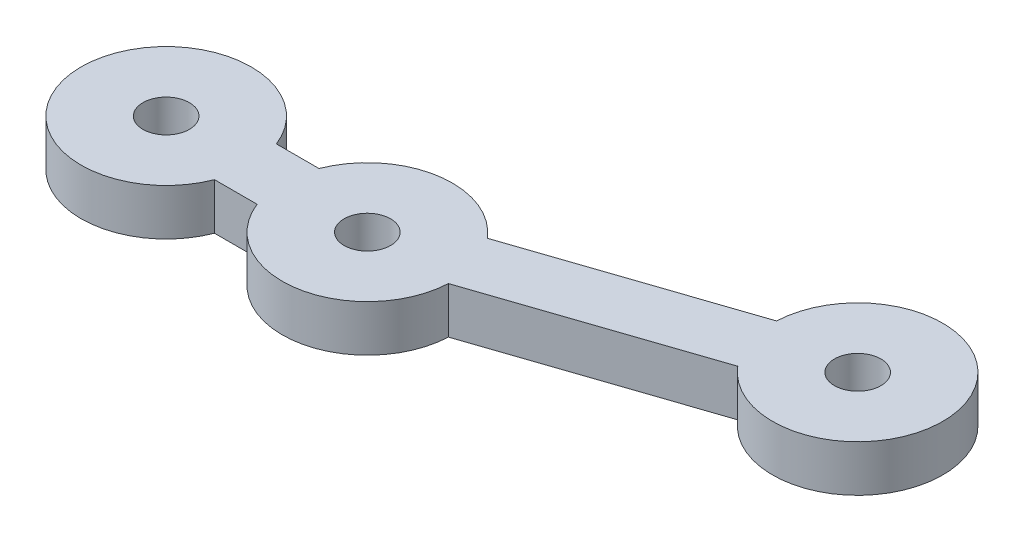
ISO-10303-21;
HEADER;
FILE_DESCRIPTION(('STEP AP214'),'2;1');
FILE_NAME('part.step','',(''),(''),'','','');
FILE_SCHEMA(('AUTOMOTIVE_DESIGN { 1 0 10303 214 1 1 1 1 }'));
ENDSEC;
DATA;
#1=APPLICATION_CONTEXT('core data for automotive mechanical design processes');
#2=APPLICATION_PROTOCOL_DEFINITION('international standard','automotive_design',2000,#1);
#3=PRODUCT_CONTEXT('',#1,'mechanical');
#4=PRODUCT('Part','Part','',(#3));
#5=PRODUCT_RELATED_PRODUCT_CATEGORY('part','',(#4));
#6=PRODUCT_DEFINITION_FORMATION('','',#4);
#7=PRODUCT_DEFINITION_CONTEXT('part definition',#1,'design');
#8=PRODUCT_DEFINITION('design','',#6,#7);
#9=PRODUCT_DEFINITION_SHAPE('','',#8);
#10=(LENGTH_UNIT() NAMED_UNIT(*) SI_UNIT(.MILLI.,.METRE.));
#11=(NAMED_UNIT(*) PLANE_ANGLE_UNIT() SI_UNIT($,.RADIAN.));
#12=(NAMED_UNIT(*) SI_UNIT($,.STERADIAN.) SOLID_ANGLE_UNIT());
#13=UNCERTAINTY_MEASURE_WITH_UNIT(LENGTH_MEASURE(1.E-05),#10,'distance_accuracy_value','');
#14=(GEOMETRIC_REPRESENTATION_CONTEXT(3) GLOBAL_UNCERTAINTY_ASSIGNED_CONTEXT((#13)) GLOBAL_UNIT_ASSIGNED_CONTEXT((#10,
#11,#12)) REPRESENTATION_CONTEXT('',''));
#15=CARTESIAN_POINT('',(0.,0.,0.));
#16=DIRECTION('',(0.,0.,1.));
#17=DIRECTION('',(1.,0.,0.));
#18=AXIS2_PLACEMENT_3D('',#15,#16,#17);
#19=CARTESIAN_POINT('',(1.9712,3.,5.83609206233075));
#20=DIRECTION('',(-0.32,0.,-0.947417542586161));
#21=DIRECTION('',(-0.947417542586161,0.,0.32));
#22=AXIS2_PLACEMENT_3D('',#19,#20,#21);
#23=PLANE('',#22);
#24=DIRECTION('',(0.947417542586161,0.,-0.32));
#25=VECTOR('',#24,1.);
#26=CARTESIAN_POINT('',(1.9712,0.,5.83609206233075));
#27=LINE('',#26,#25);
#28=CARTESIAN_POINT('',(18.4940704568434,0.,0.255322962618782));
#29=VERTEX_POINT('',#28);
#30=CARTESIAN_POINT('',(32.4713681078106,0.,-4.46565279227414));
#31=VERTEX_POINT('',#30);
#32=EDGE_CURVE('E140',#29,#31,#27,.T.);
#33=ORIENTED_EDGE('',*,*,#32,.T.);
#34=DIRECTION('',(0.,-1.,0.));
#35=VECTOR('',#34,1.);
#36=CARTESIAN_POINT('',(32.4713681078106,3.,-4.46565279227414));
#37=LINE('',#36,#35);
#38=CARTESIAN_POINT('',(32.4713681078106,3.,-4.46565279227414));
#39=VERTEX_POINT('',#38);
#40=EDGE_CURVE('E11',#39,#31,#37,.T.);
#41=ORIENTED_EDGE('',*,*,#40,.F.);
#42=DIRECTION('',(0.947417542586161,0.,-0.32));
#43=VECTOR('',#42,1.);
#44=CARTESIAN_POINT('',(1.9712,3.,5.83609206233075));
#45=LINE('',#44,#43);
#46=CARTESIAN_POINT('',(18.4940704568434,3.,0.255322962618782));
#47=VERTEX_POINT('',#46);
#48=EDGE_CURVE('E167',#47,#39,#45,.T.);
#49=ORIENTED_EDGE('',*,*,#48,.F.);
#50=DIRECTION('',(0.,-1.,0.));
#51=VECTOR('',#50,1.);
#52=CARTESIAN_POINT('',(18.4940704568434,3.,0.255322962618782));
#53=LINE('',#52,#51);
#54=EDGE_CURVE('E139',#47,#29,#53,.T.);
#55=ORIENTED_EDGE('',*,*,#54,.T.);
#56=EDGE_LOOP('',(#33,#41,#49,#55));
#57=FACE_BOUND('',#56,.T.);
#58=ADVANCED_FACE('F35',(#57),#23,.F.);
#59=CARTESIAN_POINT('',(36.685438564654,3.,-8.));
#60=DIRECTION('',(0.,-1.,0.));
#61=DIRECTION('',(0.,0.,-1.));
#62=AXIS2_PLACEMENT_3D('',#59,#60,#61);
#63=CYLINDRICAL_SURFACE('',#62,5.5);
#64=CARTESIAN_POINT('',(36.685438564654,0.,-8.));
#65=DIRECTION('',(0.,1.,0.));
#66=DIRECTION('',(0.,0.,1.));
#67=AXIS2_PLACEMENT_3D('',#64,#65,#66);
#68=CIRCLE('',#67,5.5);
#69=CARTESIAN_POINT('',(31.1913681078106,0.,-8.25532296261879));
#70=VERTEX_POINT('',#69);
#71=EDGE_CURVE('E143',#31,#70,#68,.T.);
#72=ORIENTED_EDGE('',*,*,#71,.T.);
#73=DIRECTION('',(0.,-1.,0.));
#74=VECTOR('',#73,1.);
#75=CARTESIAN_POINT('',(31.1913681078106,3.,-8.25532296261879));
#76=LINE('',#75,#74);
#77=CARTESIAN_POINT('',(31.1913681078106,3.,-8.25532296261879));
#78=VERTEX_POINT('',#77);
#79=EDGE_CURVE('E43',#78,#70,#76,.T.);
#80=ORIENTED_EDGE('',*,*,#79,.F.);
#81=CARTESIAN_POINT('',(36.685438564654,3.,-8.));
#82=DIRECTION('',(0.,1.,0.));
#83=DIRECTION('',(0.,0.,1.));
#84=AXIS2_PLACEMENT_3D('',#81,#82,#83);
#85=CIRCLE('',#84,5.5);
#86=EDGE_CURVE('E94',#39,#78,#85,.T.);
#87=ORIENTED_EDGE('',*,*,#86,.F.);
#88=ORIENTED_EDGE('',*,*,#40,.T.);
#89=EDGE_LOOP('',(#72,#80,#87,#88));
#90=FACE_BOUND('',#89,.T.);
#91=ADVANCED_FACE('F180',(#90),#63,.T.);
#92=CARTESIAN_POINT('',(0.6912,3.,2.04642189198611));
#93=DIRECTION('',(-0.32,0.,-0.947417542586161));
#94=DIRECTION('',(-0.947417542586161,0.,0.32));
#95=AXIS2_PLACEMENT_3D('',#92,#93,#94);
#96=PLANE('',#95);
#97=DIRECTION('',(0.947417542586161,0.,-0.32));
#98=VECTOR('',#97,1.);
#99=CARTESIAN_POINT('',(0.6912,0.,2.04642189198611));
#100=LINE('',#99,#98);
#101=CARTESIAN_POINT('',(17.2140704568434,0.,-3.53434720772586));
#102=VERTEX_POINT('',#101);
#103=EDGE_CURVE('E146',#102,#70,#100,.T.);
#104=ORIENTED_EDGE('',*,*,#103,.F.);
#105=DIRECTION('',(0.,-1.,0.));
#106=VECTOR('',#105,1.);
#107=CARTESIAN_POINT('',(17.2140704568434,3.,-3.53434720772586));
#108=LINE('',#107,#106);
#109=CARTESIAN_POINT('',(17.2140704568434,3.,-3.53434720772586));
#110=VERTEX_POINT('',#109);
#111=EDGE_CURVE('E173',#110,#102,#108,.T.);
#112=ORIENTED_EDGE('',*,*,#111,.F.);
#113=DIRECTION('',(0.947417542586161,0.,-0.32));
#114=VECTOR('',#113,1.);
#115=CARTESIAN_POINT('',(0.6912,3.,2.04642189198611));
#116=LINE('',#115,#114);
#117=EDGE_CURVE('E179',#110,#78,#116,.T.);
#118=ORIENTED_EDGE('',*,*,#117,.T.);
#119=ORIENTED_EDGE('',*,*,#79,.T.);
#120=EDGE_LOOP('',(#104,#112,#118,#119));
#121=FACE_BOUND('',#120,.T.);
#122=ADVANCED_FACE('F177',(#121),#96,.T.);
#123=CARTESIAN_POINT('',(13.,3.,0.));
#124=DIRECTION('',(0.,-1.,0.));
#125=DIRECTION('',(0.,0.,-1.));
#126=AXIS2_PLACEMENT_3D('',#123,#124,#125);
#127=CYLINDRICAL_SURFACE('',#126,5.5);
#128=CARTESIAN_POINT('',(13.,0.,0.));
#129=DIRECTION('',(0.,1.,0.));
#130=DIRECTION('',(0.,0.,1.));
#131=AXIS2_PLACEMENT_3D('',#128,#129,#130);
#132=CIRCLE('',#131,5.5);
#133=CARTESIAN_POINT('',(7.87652461702022,0.,-2.));
#134=VERTEX_POINT('',#133);
#135=EDGE_CURVE('E149',#102,#134,#132,.T.);
#136=ORIENTED_EDGE('',*,*,#135,.T.);
#137=DIRECTION('',(0.,-1.,0.));
#138=VECTOR('',#137,1.);
#139=CARTESIAN_POINT('',(7.87652461702022,3.,-2.));
#140=LINE('',#139,#138);
#141=CARTESIAN_POINT('',(7.87652461702022,3.,-2.));
#142=VERTEX_POINT('',#141);
#143=EDGE_CURVE('E171',#142,#134,#140,.T.);
#144=ORIENTED_EDGE('',*,*,#143,.F.);
#145=CARTESIAN_POINT('',(13.,3.,0.));
#146=DIRECTION('',(0.,1.,0.));
#147=DIRECTION('',(0.,0.,1.));
#148=AXIS2_PLACEMENT_3D('',#145,#146,#147);
#149=CIRCLE('',#148,5.5);
#150=EDGE_CURVE('E192',#110,#142,#149,.T.);
#151=ORIENTED_EDGE('',*,*,#150,.F.);
#152=ORIENTED_EDGE('',*,*,#111,.T.);
#153=EDGE_LOOP('',(#136,#144,#151,#152));
#154=FACE_BOUND('',#153,.T.);
#155=ADVANCED_FACE('F190',(#154),#127,.T.);
#156=CARTESIAN_POINT('',(0.,3.,-2.));
#157=DIRECTION('',(0.,0.,-1.));
#158=DIRECTION('',(-1.,0.,0.));
#159=AXIS2_PLACEMENT_3D('',#156,#157,#158);
#160=PLANE('',#159);
#161=DIRECTION('',(1.,0.,0.));
#162=VECTOR('',#161,1.);
#163=CARTESIAN_POINT('',(0.,0.,-2.));
#164=LINE('',#163,#162);
#165=CARTESIAN_POINT('',(5.1234753829798,0.,-2.));
#166=VERTEX_POINT('',#165);
#167=EDGE_CURVE('E152',#166,#134,#164,.T.);
#168=ORIENTED_EDGE('',*,*,#167,.F.);
#169=DIRECTION('',(0.,-1.,0.));
#170=VECTOR('',#169,1.);
#171=CARTESIAN_POINT('',(5.1234753829798,3.,-2.));
#172=LINE('',#171,#170);
#173=CARTESIAN_POINT('',(5.1234753829798,3.,-2.));
#174=VERTEX_POINT('',#173);
#175=EDGE_CURVE('E122',#174,#166,#172,.T.);
#176=ORIENTED_EDGE('',*,*,#175,.F.);
#177=DIRECTION('',(1.,0.,0.));
#178=VECTOR('',#177,1.);
#179=CARTESIAN_POINT('',(0.,3.,-2.));
#180=LINE('',#179,#178);
#181=EDGE_CURVE('E115',#174,#142,#180,.T.);
#182=ORIENTED_EDGE('',*,*,#181,.T.);
#183=ORIENTED_EDGE('',*,*,#143,.T.);
#184=EDGE_LOOP('',(#168,#176,#182,#183));
#185=FACE_BOUND('',#184,.T.);
#186=ADVANCED_FACE('F198',(#185),#160,.T.);
#187=CARTESIAN_POINT('',(0.,3.,0.));
#188=DIRECTION('',(0.,-1.,0.));
#189=DIRECTION('',(0.,0.,-1.));
#190=AXIS2_PLACEMENT_3D('',#187,#188,#189);
#191=CYLINDRICAL_SURFACE('',#190,5.5);
#192=CARTESIAN_POINT('',(0.,0.,0.));
#193=DIRECTION('',(0.,1.,0.));
#194=DIRECTION('',(0.,0.,1.));
#195=AXIS2_PLACEMENT_3D('',#192,#193,#194);
#196=CIRCLE('',#195,5.5);
#197=CARTESIAN_POINT('',(5.1234753829798,0.,2.));
#198=VERTEX_POINT('',#197);
#199=EDGE_CURVE('E121',#166,#198,#196,.T.);
#200=ORIENTED_EDGE('',*,*,#199,.T.);
#201=DIRECTION('',(0.,-1.,0.));
#202=VECTOR('',#201,1.);
#203=CARTESIAN_POINT('',(5.1234753829798,3.,2.));
#204=LINE('',#203,#202);
#205=CARTESIAN_POINT('',(5.1234753829798,3.,2.));
#206=VERTEX_POINT('',#205);
#207=EDGE_CURVE('E118',#206,#198,#204,.T.);
#208=ORIENTED_EDGE('',*,*,#207,.F.);
#209=CARTESIAN_POINT('',(0.,3.,0.));
#210=DIRECTION('',(0.,1.,0.));
#211=DIRECTION('',(0.,0.,1.));
#212=AXIS2_PLACEMENT_3D('',#209,#210,#211);
#213=CIRCLE('',#212,5.5);
#214=EDGE_CURVE('E108',#174,#206,#213,.T.);
#215=ORIENTED_EDGE('',*,*,#214,.F.);
#216=ORIENTED_EDGE('',*,*,#175,.T.);
#217=EDGE_LOOP('',(#200,#208,#215,#216));
#218=FACE_BOUND('',#217,.T.);
#219=ADVANCED_FACE('F119',(#218),#191,.T.);
#220=CARTESIAN_POINT('',(0.,3.,2.));
#221=DIRECTION('',(0.,0.,-1.));
#222=DIRECTION('',(-1.,0.,0.));
#223=AXIS2_PLACEMENT_3D('',#220,#221,#222);
#224=PLANE('',#223);
#225=DIRECTION('',(1.,0.,0.));
#226=VECTOR('',#225,1.);
#227=CARTESIAN_POINT('',(0.,0.,2.));
#228=LINE('',#227,#226);
#229=CARTESIAN_POINT('',(7.87652461702022,0.,2.));
#230=VERTEX_POINT('',#229);
#231=EDGE_CURVE('E80',#198,#230,#228,.T.);
#232=ORIENTED_EDGE('',*,*,#231,.T.);
#233=DIRECTION('',(0.,-1.,0.));
#234=VECTOR('',#233,1.);
#235=CARTESIAN_POINT('',(7.87652461702022,3.,2.));
#236=LINE('',#235,#234);
#237=CARTESIAN_POINT('',(7.87652461702022,3.,2.));
#238=VERTEX_POINT('',#237);
#239=EDGE_CURVE('E123',#238,#230,#236,.T.);
#240=ORIENTED_EDGE('',*,*,#239,.F.);
#241=DIRECTION('',(1.,0.,0.));
#242=VECTOR('',#241,1.);
#243=CARTESIAN_POINT('',(0.,3.,2.));
#244=LINE('',#243,#242);
#245=EDGE_CURVE('E113',#206,#238,#244,.T.);
#246=ORIENTED_EDGE('',*,*,#245,.F.);
#247=ORIENTED_EDGE('',*,*,#207,.T.);
#248=EDGE_LOOP('',(#232,#240,#246,#247));
#249=FACE_BOUND('',#248,.T.);
#250=ADVANCED_FACE('F125',(#249),#224,.F.);
#251=CARTESIAN_POINT('',(0.,3.,0.));
#252=DIRECTION('',(0.,-1.,0.));
#253=DIRECTION('',(0.,0.,-1.));
#254=AXIS2_PLACEMENT_3D('',#251,#252,#253);
#255=CYLINDRICAL_SURFACE('',#254,1.5);
#256=CARTESIAN_POINT('',(0.,3.,0.));
#257=DIRECTION('',(0.,1.,0.));
#258=DIRECTION('',(0.,0.,1.));
#259=AXIS2_PLACEMENT_3D('',#256,#257,#258);
#260=CIRCLE('',#259,1.5);
#261=CARTESIAN_POINT('',(0.,3.,1.5));
#262=VERTEX_POINT('',#261);
#263=EDGE_CURVE('E133',#262,#262,#260,.T.);
#264=ORIENTED_EDGE('',*,*,#263,.T.);
#265=EDGE_LOOP('',(#264));
#266=FACE_BOUND('',#265,.T.);
#267=CARTESIAN_POINT('',(0.,0.,0.));
#268=DIRECTION('',(0.,1.,0.));
#269=DIRECTION('',(0.,0.,1.));
#270=AXIS2_PLACEMENT_3D('',#267,#268,#269);
#271=CIRCLE('',#270,1.5);
#272=CARTESIAN_POINT('',(0.,0.,1.5));
#273=VERTEX_POINT('',#272);
#274=EDGE_CURVE('E161',#273,#273,#271,.T.);
#275=ORIENTED_EDGE('',*,*,#274,.F.);
#276=EDGE_LOOP('',(#275));
#277=FACE_BOUND('',#276,.T.);
#278=ADVANCED_FACE('F212',(#266,#277),#255,.F.);
#279=CARTESIAN_POINT('',(13.,3.,0.));
#280=DIRECTION('',(0.,-1.,0.));
#281=DIRECTION('',(0.,0.,-1.));
#282=AXIS2_PLACEMENT_3D('',#279,#280,#281);
#283=CYLINDRICAL_SURFACE('',#282,1.5);
#284=CARTESIAN_POINT('',(13.,3.,0.));
#285=DIRECTION('',(0.,1.,0.));
#286=DIRECTION('',(0.,0.,1.));
#287=AXIS2_PLACEMENT_3D('',#284,#285,#286);
#288=CIRCLE('',#287,1.5);
#289=CARTESIAN_POINT('',(13.,3.,1.5));
#290=VERTEX_POINT('',#289);
#291=EDGE_CURVE('E127',#290,#290,#288,.T.);
#292=ORIENTED_EDGE('',*,*,#291,.T.);
#293=EDGE_LOOP('',(#292));
#294=FACE_BOUND('',#293,.T.);
#295=CARTESIAN_POINT('',(13.,0.,0.));
#296=DIRECTION('',(0.,1.,0.));
#297=DIRECTION('',(0.,0.,1.));
#298=AXIS2_PLACEMENT_3D('',#295,#296,#297);
#299=CIRCLE('',#298,1.5);
#300=CARTESIAN_POINT('',(13.,0.,1.5));
#301=VERTEX_POINT('',#300);
#302=EDGE_CURVE('E158',#301,#301,#299,.T.);
#303=ORIENTED_EDGE('',*,*,#302,.F.);
#304=EDGE_LOOP('',(#303));
#305=FACE_BOUND('',#304,.T.);
#306=ADVANCED_FACE('F204',(#294,#305),#283,.F.);
#307=CARTESIAN_POINT('',(13.,3.,0.));
#308=DIRECTION('',(0.,-1.,0.));
#309=DIRECTION('',(0.,0.,-1.));
#310=AXIS2_PLACEMENT_3D('',#307,#308,#309);
#311=CYLINDRICAL_SURFACE('',#310,5.5);
#312=CARTESIAN_POINT('',(13.,0.,0.));
#313=DIRECTION('',(0.,1.,0.));
#314=DIRECTION('',(0.,0.,1.));
#315=AXIS2_PLACEMENT_3D('',#312,#313,#314);
#316=CIRCLE('',#315,5.5);
#317=EDGE_CURVE('E86',#230,#29,#316,.T.);
#318=ORIENTED_EDGE('',*,*,#317,.T.);
#319=ORIENTED_EDGE('',*,*,#54,.F.);
#320=CARTESIAN_POINT('',(13.,3.,0.));
#321=DIRECTION('',(0.,1.,0.));
#322=DIRECTION('',(0.,0.,1.));
#323=AXIS2_PLACEMENT_3D('',#320,#321,#322);
#324=CIRCLE('',#323,5.5);
#325=EDGE_CURVE('E51',#238,#47,#324,.T.);
#326=ORIENTED_EDGE('',*,*,#325,.F.);
#327=ORIENTED_EDGE('',*,*,#239,.T.);
#328=EDGE_LOOP('',(#318,#319,#326,#327));
#329=FACE_BOUND('',#328,.T.);
#330=ADVANCED_FACE('F201',(#329),#311,.T.);
#331=CARTESIAN_POINT('',(36.685438564654,3.,-8.));
#332=DIRECTION('',(0.,-1.,0.));
#333=DIRECTION('',(0.,0.,-1.));
#334=AXIS2_PLACEMENT_3D('',#331,#332,#333);
#335=CYLINDRICAL_SURFACE('',#334,1.5);
#336=CARTESIAN_POINT('',(36.685438564654,3.,-8.));
#337=DIRECTION('',(0.,1.,0.));
#338=DIRECTION('',(0.,0.,1.));
#339=AXIS2_PLACEMENT_3D('',#336,#337,#338);
#340=CIRCLE('',#339,1.5);
#341=CARTESIAN_POINT('',(36.685438564654,3.,-6.5));
#342=VERTEX_POINT('',#341);
#343=EDGE_CURVE('E136',#342,#342,#340,.T.);
#344=ORIENTED_EDGE('',*,*,#343,.T.);
#345=EDGE_LOOP('',(#344));
#346=FACE_BOUND('',#345,.T.);
#347=CARTESIAN_POINT('',(36.685438564654,0.,-8.));
#348=DIRECTION('',(0.,1.,0.));
#349=DIRECTION('',(0.,0.,1.));
#350=AXIS2_PLACEMENT_3D('',#347,#348,#349);
#351=CIRCLE('',#350,1.5);
#352=CARTESIAN_POINT('',(36.685438564654,0.,-6.5));
#353=VERTEX_POINT('',#352);
#354=EDGE_CURVE('E164',#353,#353,#351,.T.);
#355=ORIENTED_EDGE('',*,*,#354,.F.);
#356=EDGE_LOOP('',(#355));
#357=FACE_BOUND('',#356,.T.);
#358=ADVANCED_FACE('F203',(#346,#357),#335,.F.);
#359=CARTESIAN_POINT('',(0.,3.,0.));
#360=DIRECTION('',(0.,1.,0.));
#361=DIRECTION('',(0.,0.,1.));
#362=AXIS2_PLACEMENT_3D('',#359,#360,#361);
#363=PLANE('',#362);
#364=ORIENTED_EDGE('',*,*,#48,.T.);
#365=ORIENTED_EDGE('',*,*,#86,.T.);
#366=ORIENTED_EDGE('',*,*,#117,.F.);
#367=ORIENTED_EDGE('',*,*,#150,.T.);
#368=ORIENTED_EDGE('',*,*,#181,.F.);
#369=ORIENTED_EDGE('',*,*,#214,.T.);
#370=ORIENTED_EDGE('',*,*,#245,.T.);
#371=ORIENTED_EDGE('',*,*,#325,.T.);
#372=EDGE_LOOP('',(#364,#365,#366,#367,#368,#369,#370,#371));
#373=FACE_BOUND('',#372,.T.);
#374=ORIENTED_EDGE('',*,*,#291,.F.);
#375=EDGE_LOOP('',(#374));
#376=FACE_BOUND('',#375,.T.);
#377=ORIENTED_EDGE('',*,*,#263,.F.);
#378=EDGE_LOOP('',(#377));
#379=FACE_BOUND('',#378,.T.);
#380=ORIENTED_EDGE('',*,*,#343,.F.);
#381=EDGE_LOOP('',(#380));
#382=FACE_BOUND('',#381,.T.);
#383=ADVANCED_FACE('F110',(#373,#376,#379,#382),#363,.T.);
#384=CARTESIAN_POINT('',(0.,0.,0.));
#385=DIRECTION('',(0.,1.,0.));
#386=DIRECTION('',(0.,0.,1.));
#387=AXIS2_PLACEMENT_3D('',#384,#385,#386);
#388=PLANE('',#387);
#389=ORIENTED_EDGE('',*,*,#32,.F.);
#390=ORIENTED_EDGE('',*,*,#317,.F.);
#391=ORIENTED_EDGE('',*,*,#231,.F.);
#392=ORIENTED_EDGE('',*,*,#199,.F.);
#393=ORIENTED_EDGE('',*,*,#167,.T.);
#394=ORIENTED_EDGE('',*,*,#135,.F.);
#395=ORIENTED_EDGE('',*,*,#103,.T.);
#396=ORIENTED_EDGE('',*,*,#71,.F.);
#397=EDGE_LOOP('',(#389,#390,#391,#392,#393,#394,#395,#396));
#398=FACE_BOUND('',#397,.T.);
#399=ORIENTED_EDGE('',*,*,#302,.T.);
#400=EDGE_LOOP('',(#399));
#401=FACE_BOUND('',#400,.T.);
#402=ORIENTED_EDGE('',*,*,#274,.T.);
#403=EDGE_LOOP('',(#402));
#404=FACE_BOUND('',#403,.T.);
#405=ORIENTED_EDGE('',*,*,#354,.T.);
#406=EDGE_LOOP('',(#405));
#407=FACE_BOUND('',#406,.T.);
#408=ADVANCED_FACE('F185',(#398,#401,#404,#407),#388,.F.);
#409=CLOSED_SHELL('',(#58,#91,#122,#155,#186,#219,#250,#278,#306,#330,#358,#383,#408));
#410=MANIFOLD_SOLID_BREP('B2',#409);
#411=ADVANCED_BREP_SHAPE_REPRESENTATION('',(#18,#410),#14);
#412=SHAPE_DEFINITION_REPRESENTATION(#9,#411);
ENDSEC;
END-ISO-10303-21;
